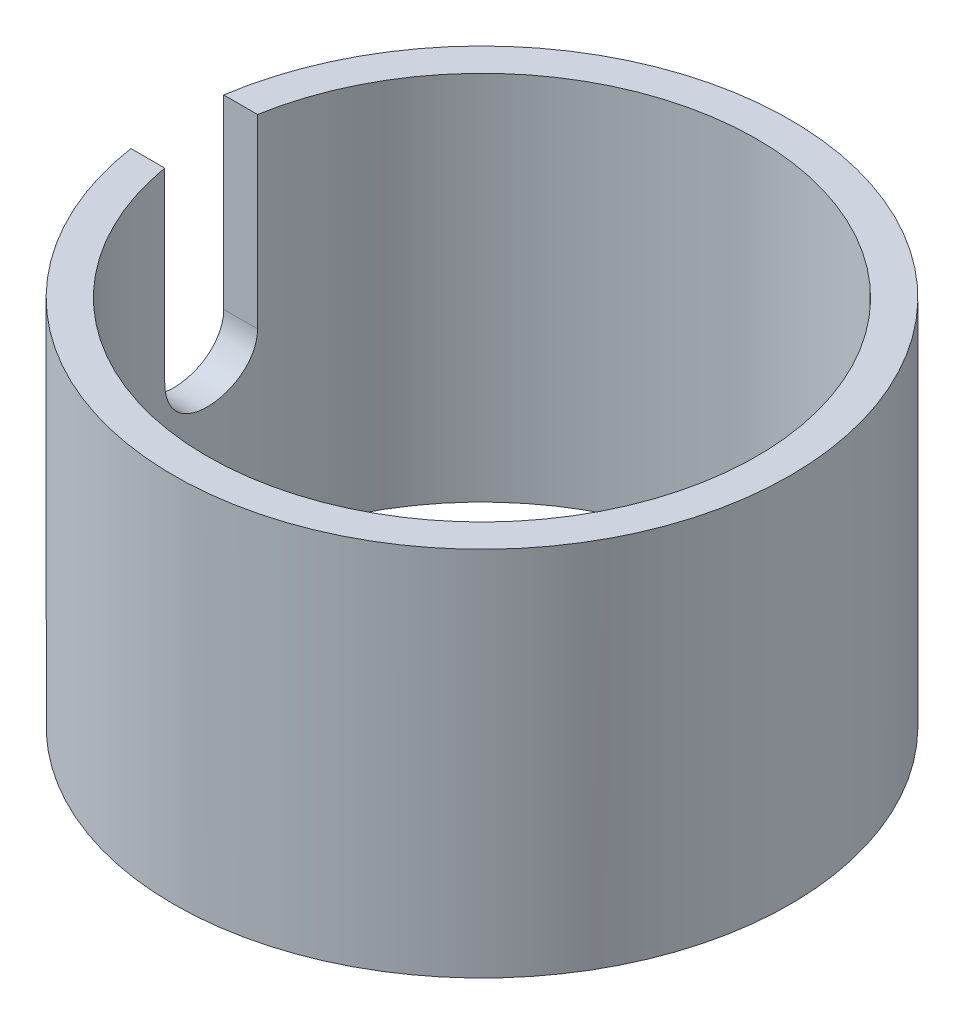
ISO-10303-21;
HEADER;
FILE_DESCRIPTION(('STEP AP214'),'2;1');
FILE_NAME('part.step','',(''),(''),'','','');
FILE_SCHEMA(('AUTOMOTIVE_DESIGN { 1 0 10303 214 1 1 1 1 }'));
ENDSEC;
DATA;
#1=APPLICATION_CONTEXT('core data for automotive mechanical design processes');
#2=APPLICATION_PROTOCOL_DEFINITION('international standard','automotive_design',2000,#1);
#3=PRODUCT_CONTEXT('',#1,'mechanical');
#4=PRODUCT('Part','Part','',(#3));
#5=PRODUCT_RELATED_PRODUCT_CATEGORY('part','',(#4));
#6=PRODUCT_DEFINITION_FORMATION('','',#4);
#7=PRODUCT_DEFINITION_CONTEXT('part definition',#1,'design');
#8=PRODUCT_DEFINITION('design','',#6,#7);
#9=PRODUCT_DEFINITION_SHAPE('','',#8);
#10=(LENGTH_UNIT() NAMED_UNIT(*) SI_UNIT(.MILLI.,.METRE.));
#11=(NAMED_UNIT(*) PLANE_ANGLE_UNIT() SI_UNIT($,.RADIAN.));
#12=(NAMED_UNIT(*) SI_UNIT($,.STERADIAN.) SOLID_ANGLE_UNIT());
#13=UNCERTAINTY_MEASURE_WITH_UNIT(LENGTH_MEASURE(1.E-05),#10,'distance_accuracy_value','');
#14=(GEOMETRIC_REPRESENTATION_CONTEXT(3) GLOBAL_UNCERTAINTY_ASSIGNED_CONTEXT((#13)) GLOBAL_UNIT_ASSIGNED_CONTEXT((#10,
#11,#12)) REPRESENTATION_CONTEXT('',''));
#15=CARTESIAN_POINT('',(0.,0.,0.));
#16=DIRECTION('',(0.,0.,1.));
#17=DIRECTION('',(1.,0.,0.));
#18=AXIS2_PLACEMENT_3D('',#15,#16,#17);
#19=CARTESIAN_POINT('',(0.,12.7,0.));
#20=DIRECTION('',(0.,-1.,0.));
#21=DIRECTION('',(0.,0.,-1.));
#22=AXIS2_PLACEMENT_3D('',#19,#20,#21);
#23=CYLINDRICAL_SURFACE('',#22,9.398);
#24=CARTESIAN_POINT('',(0.,0.,0.));
#25=DIRECTION('',(0.,1.,0.));
#26=DIRECTION('',(0.,0.,1.));
#27=AXIS2_PLACEMENT_3D('',#24,#25,#26);
#28=CIRCLE('',#27,9.398);
#29=CARTESIAN_POINT('',(0.,0.,9.398));
#30=VERTEX_POINT('',#29);
#31=EDGE_CURVE('E102',#30,#30,#28,.T.);
#32=ORIENTED_EDGE('',*,*,#31,.F.);
#33=EDGE_LOOP('',(#32));
#34=FACE_BOUND('',#33,.T.);
#35=CARTESIAN_POINT('',(0.,12.7,0.));
#36=DIRECTION('',(0.,1.,0.));
#37=DIRECTION('',(0.,0.,1.));
#38=AXIS2_PLACEMENT_3D('',#35,#36,#37);
#39=CIRCLE('',#38,9.398);
#40=CARTESIAN_POINT('',(-9.2629502724564,12.7,1.5875));
#41=VERTEX_POINT('',#40);
#42=CARTESIAN_POINT('',(-9.2629502724564,12.7,-1.5875));
#43=VERTEX_POINT('',#42);
#44=EDGE_CURVE('E93',#41,#43,#39,.T.);
#45=ORIENTED_EDGE('',*,*,#44,.T.);
#46=DIRECTION('',(0.,-1.,0.));
#47=VECTOR('',#46,1.);
#48=CARTESIAN_POINT('',(-9.2629502724564,12.7,-1.5875));
#49=LINE('',#48,#47);
#50=CARTESIAN_POINT('',(-9.2629502724564,6.35,-1.5875));
#51=VERTEX_POINT('',#50);
#52=EDGE_CURVE('E63',#43,#51,#49,.T.);
#53=ORIENTED_EDGE('',*,*,#52,.T.);
#54=CARTESIAN_POINT('',(-9.2629502724564,6.35,-1.5875));
#55=CARTESIAN_POINT('',(-9.2629483944086,6.30567690418906,-1.58750008313143));
#56=CARTESIAN_POINT('',(-9.26326880583968,6.26137535961334,-1.58564257143254));
#57=CARTESIAN_POINT('',(-9.26453453595528,6.1730956068355,-1.57823469104071));
#58=CARTESIAN_POINT('',(-9.26547979118527,6.12911736625948,-1.57268469732881));
#59=CARTESIAN_POINT('',(-9.26921799056857,5.99826443926311,-1.55056105844258));
#60=CARTESIAN_POINT('',(-9.27291353687855,5.91227627020139,-1.52851352841433));
#61=CARTESIAN_POINT('',(-9.28229213921793,5.7452906660226,-1.47047935470392));
#62=CARTESIAN_POINT('',(-9.28797561842218,5.66429429784051,-1.43448974297017));
#63=CARTESIAN_POINT('',(-9.30068693708451,5.50947354334279,-1.34961521145539));
#64=CARTESIAN_POINT('',(-9.30771480160455,5.43564929076797,-1.30073005126993));
#65=CARTESIAN_POINT('',(-9.32240137065652,5.29655037375563,-1.1909335476251));
#66=CARTESIAN_POINT('',(-9.33006515801227,5.23135813685505,-1.1299184910535));
#67=CARTESIAN_POINT('',(-9.34511578231427,5.11207823010617,-0.997811013261485));
#68=CARTESIAN_POINT('',(-9.3525025766396,5.05799226349517,-0.926717049180016));
#69=CARTESIAN_POINT('',(-9.36622050280361,4.96215645191149,-0.775934523750244));
#70=CARTESIAN_POINT('',(-9.37254489823619,4.92048411936864,-0.696196032424174));
#71=CARTESIAN_POINT('',(-9.38336795931481,4.85115864221261,-0.53073056872449));
#72=CARTESIAN_POINT('',(-9.38786685030536,4.82350376714673,-0.44500433702378));
#73=CARTESIAN_POINT('',(-9.3944962761452,4.78324978521652,-0.270853285767469));
#74=CARTESIAN_POINT('',(-9.39664881321666,4.77051072447994,-0.182461666982638));
#75=CARTESIAN_POINT('',(-9.39841864234318,4.76001460945308,-0.00476904965193792));
#76=CARTESIAN_POINT('',(-9.39803605114694,4.76225686523747,0.0845319068276532));
#77=CARTESIAN_POINT('',(-9.39479603020996,4.78155132990318,0.260546474275923));
#78=CARTESIAN_POINT('',(-9.39196383812,4.79845251628538,0.347277171233603));
#79=CARTESIAN_POINT('',(-9.38417103122454,4.84634705971191,0.516653016462905));
#80=CARTESIAN_POINT('',(-9.37921036391574,4.87734076437896,0.599298063897307));
#81=CARTESIAN_POINT('',(-9.36767500937727,4.95269056494714,0.758606574349384));
#82=CARTESIAN_POINT('',(-9.36109282741047,4.99710893308772,0.835240018831298));
#83=CARTESIAN_POINT('',(-9.34704573595857,5.0979999940934,0.980019604154157));
#84=CARTESIAN_POINT('',(-9.33958078568435,5.1544732440625,1.04816535251438));
#85=CARTESIAN_POINT('',(-9.32448888674047,5.27869943368509,1.17492260708964));
#86=CARTESIAN_POINT('',(-9.31686107575032,5.34658296962673,1.2334060788123));
#87=CARTESIAN_POINT('',(-9.30238995771964,5.49128974123272,1.33819011000391));
#88=CARTESIAN_POINT('',(-9.29554687417481,5.56811551121453,1.3844872035489));
#89=CARTESIAN_POINT('',(-9.28341845803078,5.72868748569242,1.46361097113479));
#90=CARTESIAN_POINT('',(-9.27813586029703,5.81244551454549,1.49641403492525));
#91=CARTESIAN_POINT('',(-9.26976958366135,5.98433498997815,1.54740258342308));
#92=CARTESIAN_POINT('',(-9.26668261904777,6.07245968962952,1.56560991549963));
#93=CARTESIAN_POINT('',(-9.2642319319958,6.19271396989997,1.58000567820761));
#94=CARTESIAN_POINT('',(-9.26375174493372,6.22413129674857,1.58281721011461));
#95=CARTESIAN_POINT('',(-9.26311123504053,6.28702782620716,1.58656193027142));
#96=CARTESIAN_POINT('',(-9.26295037431228,6.31850683520311,1.58749827724651));
#97=CARTESIAN_POINT('',(-9.2629502724564,6.35,1.5875));
#98=B_SPLINE_CURVE_WITH_KNOTS('',3,(#54,#55,#56,#57,#58,#59,#60,#61,#62,#63,#64,#65,#66,#67,#68,
#69,#70,#71,#72,#73,#74,#75,#76,#77,#78,#79,#80,#81,#82,#83,#84,#85,#86,#87,#88,#89,#90,#91,#92,
#93,#94,#95,#96,#97),.UNSPECIFIED.,.F.,.F.,(4,2,2,2,2,2,2,2,2,2,2,2,2,2,2,2,2,2,2,2,2,4),(0.,
0.132886598695041,0.265759704474088,0.530927625381221,0.796152027448463,1.06138137429373,
1.32898439524726,1.59662842471163,1.86591022165392,2.13515876770383,2.40186020057051,
2.66854935128522,2.93252316112175,3.1965034828016,3.4617276151964,3.72696400730714,
3.99547353496262,4.26405934701519,4.53311312004214,4.80176340863219,4.89635980272843,
4.99079671591293),.UNSPECIFIED.);
#99=CARTESIAN_POINT('',(-9.2629502724564,6.35,1.5875));
#100=VERTEX_POINT('',#99);
#101=EDGE_CURVE('E94',#51,#100,#98,.T.);
#102=ORIENTED_EDGE('',*,*,#101,.T.);
#103=DIRECTION('',(0.,-1.,0.));
#104=VECTOR('',#103,1.);
#105=CARTESIAN_POINT('',(-9.2629502724564,12.7,1.5875));
#106=LINE('',#105,#104);
#107=EDGE_CURVE('E82',#41,#100,#106,.T.);
#108=ORIENTED_EDGE('',*,*,#107,.F.);
#109=EDGE_LOOP('',(#45,#53,#102,#108));
#110=FACE_BOUND('',#109,.T.);
#111=ADVANCED_FACE('F35',(#34,#110),#23,.F.);
#112=CARTESIAN_POINT('',(0.,12.7,0.));
#113=DIRECTION('',(0.,-1.,0.));
#114=DIRECTION('',(0.,0.,-1.));
#115=AXIS2_PLACEMENT_3D('',#112,#113,#114);
#116=CYLINDRICAL_SURFACE('',#115,10.541);
#117=CARTESIAN_POINT('',(0.,0.,0.));
#118=DIRECTION('',(0.,1.,0.));
#119=DIRECTION('',(0.,0.,1.));
#120=AXIS2_PLACEMENT_3D('',#117,#118,#119);
#121=CIRCLE('',#120,10.541);
#122=CARTESIAN_POINT('',(0.,0.,10.541));
#123=VERTEX_POINT('',#122);
#124=EDGE_CURVE('E98',#123,#123,#121,.T.);
#125=ORIENTED_EDGE('',*,*,#124,.T.);
#126=EDGE_LOOP('',(#125));
#127=FACE_BOUND('',#126,.T.);
#128=DIRECTION('',(0.,-1.,0.));
#129=VECTOR('',#128,1.);
#130=CARTESIAN_POINT('',(-10.420773711678,12.7,-1.5875));
#131=LINE('',#130,#129);
#132=CARTESIAN_POINT('',(-10.420773711678,12.7,-1.5875));
#133=VERTEX_POINT('',#132);
#134=CARTESIAN_POINT('',(-10.420773711678,6.35,-1.5875));
#135=VERTEX_POINT('',#134);
#136=EDGE_CURVE('E95',#133,#135,#131,.T.);
#137=ORIENTED_EDGE('',*,*,#136,.F.);
#138=CARTESIAN_POINT('',(0.,12.7,0.));
#139=DIRECTION('',(0.,1.,0.));
#140=DIRECTION('',(0.,0.,1.));
#141=AXIS2_PLACEMENT_3D('',#138,#139,#140);
#142=CIRCLE('',#141,10.541);
#143=CARTESIAN_POINT('',(-10.420773711678,12.7,1.5875));
#144=VERTEX_POINT('',#143);
#145=EDGE_CURVE('E88',#144,#133,#142,.T.);
#146=ORIENTED_EDGE('',*,*,#145,.F.);
#147=DIRECTION('',(0.,-1.,0.));
#148=VECTOR('',#147,1.);
#149=CARTESIAN_POINT('',(-10.420773711678,12.7,1.5875));
#150=LINE('',#149,#148);
#151=CARTESIAN_POINT('',(-10.420773711678,6.35,1.5875));
#152=VERTEX_POINT('',#151);
#153=EDGE_CURVE('E55',#144,#152,#150,.T.);
#154=ORIENTED_EDGE('',*,*,#153,.T.);
#155=CARTESIAN_POINT('',(-10.420773711678,6.35,-1.5875));
#156=CARTESIAN_POINT('',(-10.4207720547917,6.30560700394498,-1.58750000523293));
#157=CARTESIAN_POINT('',(-10.4210577475531,6.26123552609864,-1.58563671006583));
#158=CARTESIAN_POINT('',(-10.4221864356395,6.17281508817855,-1.57820524615007));
#159=CARTESIAN_POINT('',(-10.4230293806032,6.1287660993238,-1.57263741219574));
#160=CARTESIAN_POINT('',(-10.4263635032984,5.99768999995789,-1.55043967098387));
#161=CARTESIAN_POINT('',(-10.4296601095281,5.91154882158084,-1.52831531580908));
#162=CARTESIAN_POINT('',(-10.438028707372,5.74425887255445,-1.4700654864179));
#163=CARTESIAN_POINT('',(-10.4431011692069,5.66311143087168,-1.43393630365511));
#164=CARTESIAN_POINT('',(-10.4544475362336,5.5080187590654,-1.34872107807203));
#165=CARTESIAN_POINT('',(-10.4607214113202,5.43407334854268,-1.29963535990626));
#166=CARTESIAN_POINT('',(-10.4738193884355,5.29491171237486,-1.18948607695393));
#167=CARTESIAN_POINT('',(-10.4806470860269,5.22976130220306,-1.12833981621808));
#168=CARTESIAN_POINT('',(-10.4940520933085,5.11059748222054,-0.995976152235253));
#169=CARTESIAN_POINT('',(-10.5006293646041,5.05658577459487,-0.924757212509162));
#170=CARTESIAN_POINT('',(-10.5128297387788,4.96099654330217,-0.773848261753772));
#171=CARTESIAN_POINT('',(-10.5184480848375,4.91948026989479,-0.694119037091135));
#172=CARTESIAN_POINT('',(-10.5280570014453,4.85045533782409,-0.52872504838671));
#173=CARTESIAN_POINT('',(-10.5320477527691,4.82294512344303,-0.443060944760735));
#174=CARTESIAN_POINT('',(-10.5379266381309,4.78291173143826,-0.268910723124196));
#175=CARTESIAN_POINT('',(-10.5398304143269,4.7702770063655,-0.180450784074249));
#176=CARTESIAN_POINT('',(-10.5413744818004,4.760006780414,-0.00264516808376232));
#177=CARTESIAN_POINT('',(-10.5410148457127,4.76237079821367,0.0867004803417905));
#178=CARTESIAN_POINT('',(-10.5380850198192,4.78194350867928,0.262975530070672));
#179=CARTESIAN_POINT('',(-10.535532762133,4.79903178397038,0.349918642335862));
#180=CARTESIAN_POINT('',(-10.5285244751437,4.84737880448368,0.519688571135018));
#181=CARTESIAN_POINT('',(-10.5240684079143,4.87863783200554,0.602515305628954));
#182=CARTESIAN_POINT('',(-10.5137222969497,4.95456278327266,0.762067563102867));
#183=CARTESIAN_POINT('',(-10.5078268251943,4.99927960870826,0.838768497422589));
#184=CARTESIAN_POINT('',(-10.4952592066059,5.10081195942218,0.983620359526699));
#185=CARTESIAN_POINT('',(-10.4885870387573,5.15762781210768,1.05177105585702));
#186=CARTESIAN_POINT('',(-10.4751325767563,5.28240729416323,1.1782927170785));
#187=CARTESIAN_POINT('',(-10.4683498439607,5.35047461739055,1.23656140369072));
#188=CARTESIAN_POINT('',(-10.4555004087802,5.49549992630396,1.34088202084206));
#189=CARTESIAN_POINT('',(-10.4494339141233,5.5724604785177,1.38693041198118));
#190=CARTESIAN_POINT('',(-10.4387030767281,5.73320528703311,1.4655171461965));
#191=CARTESIAN_POINT('',(-10.4340406598456,5.81699871716398,1.49803695634548));
#192=CARTESIAN_POINT('',(-10.4266770312847,5.98888513462469,1.54846618267277));
#193=CARTESIAN_POINT('',(-10.4239728804662,6.07697146579948,1.56639749957496));
#194=CARTESIAN_POINT('',(-10.4218597904896,6.19642731120015,1.58035614438962));
#195=CARTESIAN_POINT('',(-10.4214528425168,6.22710646707317,1.5830362765757));
#196=CARTESIAN_POINT('',(-10.4209100956052,6.28851933440263,1.58660584311233));
#197=CARTESIAN_POINT('',(-10.420773840893,6.31925286680286,1.58749828746145));
#198=CARTESIAN_POINT('',(-10.420773711678,6.35,1.5875));
#199=B_SPLINE_CURVE_WITH_KNOTS('',3,(#155,#156,#157,#158,#159,#160,#161,#162,#163,#164,#165,
#166,#167,#168,#169,#170,#171,#172,#173,#174,#175,#176,#177,#178,#179,#180,#181,#182,#183,#184,
#185,#186,#187,#188,#189,#190,#191,#192,#193,#194,#195,#196,#197,#198),.UNSPECIFIED.,.F.,.F.,(4,
2,2,2,2,2,2,2,2,2,2,2,2,2,2,2,2,2,2,2,2,4),(0.,0.133096383657311,0.26618074048272,
0.531801774099383,0.797493193559574,1.06317795616812,1.33075208712153,1.59836707774723,
1.86727326723589,2.13614958155082,2.40299655369557,2.66983496255192,2.93451161444926,
3.19919353927858,3.46488943334346,3.73059251821798,3.99889690481012,4.26727891658554,
4.53602738618986,4.80437165343513,4.89672827821265,4.98892926744757),.UNSPECIFIED.);
#200=EDGE_CURVE('E11',#135,#152,#199,.T.);
#201=ORIENTED_EDGE('',*,*,#200,.F.);
#202=EDGE_LOOP('',(#137,#146,#154,#201));
#203=FACE_BOUND('',#202,.T.);
#204=ADVANCED_FACE('F126',(#127,#203),#116,.T.);
#205=CARTESIAN_POINT('',(0.,12.7,0.));
#206=DIRECTION('',(0.,1.,0.));
#207=DIRECTION('',(0.,0.,1.));
#208=AXIS2_PLACEMENT_3D('',#205,#206,#207);
#209=PLANE('',#208);
#210=ORIENTED_EDGE('',*,*,#145,.T.);
#211=DIRECTION('',(1.,0.,0.));
#212=VECTOR('',#211,1.);
#213=CARTESIAN_POINT('',(0.,12.7,-1.5875));
#214=LINE('',#213,#212);
#215=EDGE_CURVE('E48',#133,#43,#214,.T.);
#216=ORIENTED_EDGE('',*,*,#215,.T.);
#217=ORIENTED_EDGE('',*,*,#44,.F.);
#218=DIRECTION('',(1.,0.,0.));
#219=VECTOR('',#218,1.);
#220=CARTESIAN_POINT('',(0.,12.7,1.5875));
#221=LINE('',#220,#219);
#222=EDGE_CURVE('E79',#144,#41,#221,.T.);
#223=ORIENTED_EDGE('',*,*,#222,.F.);
#224=EDGE_LOOP('',(#210,#216,#217,#223));
#225=FACE_BOUND('',#224,.T.);
#226=ADVANCED_FACE('F97',(#225),#209,.T.);
#227=CARTESIAN_POINT('',(0.,0.,0.));
#228=DIRECTION('',(0.,1.,0.));
#229=DIRECTION('',(0.,0.,1.));
#230=AXIS2_PLACEMENT_3D('',#227,#228,#229);
#231=PLANE('',#230);
#232=ORIENTED_EDGE('',*,*,#31,.T.);
#233=EDGE_LOOP('',(#232));
#234=FACE_BOUND('',#233,.T.);
#235=ORIENTED_EDGE('',*,*,#124,.F.);
#236=EDGE_LOOP('',(#235));
#237=FACE_BOUND('',#236,.T.);
#238=ADVANCED_FACE('F135',(#234,#237),#231,.F.);
#239=CARTESIAN_POINT('',(-12.7,6.35,0.));
#240=DIRECTION('',(1.,0.,0.));
#241=DIRECTION('',(0.,0.,-1.));
#242=AXIS2_PLACEMENT_3D('',#239,#240,#241);
#243=CYLINDRICAL_SURFACE('',#242,1.5875);
#244=DIRECTION('',(1.,0.,0.));
#245=VECTOR('',#244,1.);
#246=CARTESIAN_POINT('',(-12.7,6.35,-1.5875));
#247=LINE('',#246,#245);
#248=EDGE_CURVE('E117',#135,#51,#247,.T.);
#249=ORIENTED_EDGE('',*,*,#248,.F.);
#250=ORIENTED_EDGE('',*,*,#200,.T.);
#251=DIRECTION('',(1.,0.,0.));
#252=VECTOR('',#251,1.);
#253=CARTESIAN_POINT('',(-12.7,6.35,1.5875));
#254=LINE('',#253,#252);
#255=EDGE_CURVE('E119',#152,#100,#254,.T.);
#256=ORIENTED_EDGE('',*,*,#255,.T.);
#257=ORIENTED_EDGE('',*,*,#101,.F.);
#258=EDGE_LOOP('',(#249,#250,#256,#257));
#259=FACE_BOUND('',#258,.T.);
#260=ADVANCED_FACE('F122',(#259),#243,.F.);
#261=CARTESIAN_POINT('',(-12.7,12.7,-1.5875));
#262=DIRECTION('',(0.,0.,1.));
#263=DIRECTION('',(0.,-1.,0.));
#264=AXIS2_PLACEMENT_3D('',#261,#262,#263);
#265=PLANE('',#264);
#266=ORIENTED_EDGE('',*,*,#215,.F.);
#267=ORIENTED_EDGE('',*,*,#136,.T.);
#268=ORIENTED_EDGE('',*,*,#248,.T.);
#269=ORIENTED_EDGE('',*,*,#52,.F.);
#270=EDGE_LOOP('',(#266,#267,#268,#269));
#271=FACE_BOUND('',#270,.T.);
#272=ADVANCED_FACE('F127',(#271),#265,.T.);
#273=CARTESIAN_POINT('',(-12.7,12.7,1.5875));
#274=DIRECTION('',(0.,0.,1.));
#275=DIRECTION('',(0.,-1.,0.));
#276=AXIS2_PLACEMENT_3D('',#273,#274,#275);
#277=PLANE('',#276);
#278=ORIENTED_EDGE('',*,*,#107,.T.);
#279=ORIENTED_EDGE('',*,*,#255,.F.);
#280=ORIENTED_EDGE('',*,*,#153,.F.);
#281=ORIENTED_EDGE('',*,*,#222,.T.);
#282=EDGE_LOOP('',(#278,#279,#280,#281));
#283=FACE_BOUND('',#282,.T.);
#284=ADVANCED_FACE('F81',(#283),#277,.F.);
#285=CLOSED_SHELL('',(#111,#204,#226,#238,#260,#272,#284));
#286=MANIFOLD_SOLID_BREP('B2',#285);
#287=ADVANCED_BREP_SHAPE_REPRESENTATION('',(#18,#286),#14);
#288=SHAPE_DEFINITION_REPRESENTATION(#9,#287);
ENDSEC;
END-ISO-10303-21;
